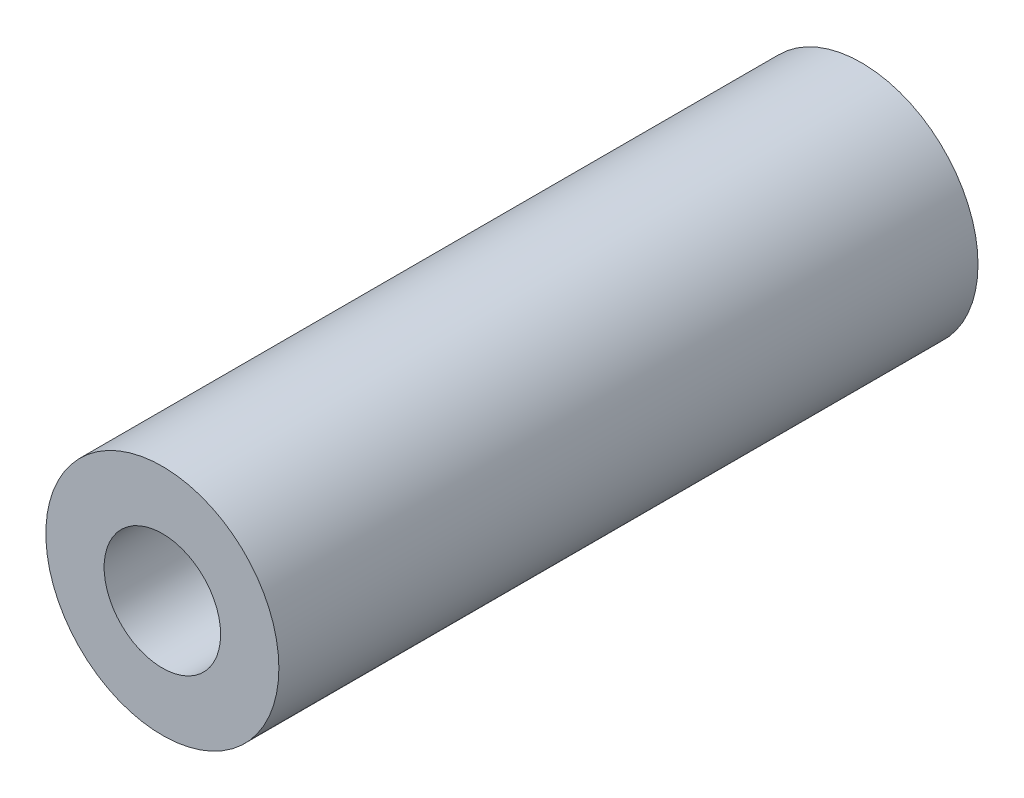
ISO-10303-21;
HEADER;
FILE_DESCRIPTION(('STEP AP214'),'2;1');
FILE_NAME('part.step','',(''),(''),'','','');
FILE_SCHEMA(('AUTOMOTIVE_DESIGN { 1 0 10303 214 1 1 1 1 }'));
ENDSEC;
DATA;
#1=APPLICATION_CONTEXT('core data for automotive mechanical design processes');
#2=APPLICATION_PROTOCOL_DEFINITION('international standard','automotive_design',2000,#1);
#3=PRODUCT_CONTEXT('',#1,'mechanical');
#4=PRODUCT('Part','Part','',(#3));
#5=PRODUCT_RELATED_PRODUCT_CATEGORY('part','',(#4));
#6=PRODUCT_DEFINITION_FORMATION('','',#4);
#7=PRODUCT_DEFINITION_CONTEXT('part definition',#1,'design');
#8=PRODUCT_DEFINITION('design','',#6,#7);
#9=PRODUCT_DEFINITION_SHAPE('','',#8);
#10=(LENGTH_UNIT() NAMED_UNIT(*) SI_UNIT(.MILLI.,.METRE.));
#11=(NAMED_UNIT(*) PLANE_ANGLE_UNIT() SI_UNIT($,.RADIAN.));
#12=(NAMED_UNIT(*) SI_UNIT($,.STERADIAN.) SOLID_ANGLE_UNIT());
#13=UNCERTAINTY_MEASURE_WITH_UNIT(LENGTH_MEASURE(1.E-05),#10,'distance_accuracy_value','');
#14=(GEOMETRIC_REPRESENTATION_CONTEXT(3) GLOBAL_UNCERTAINTY_ASSIGNED_CONTEXT((#13)) GLOBAL_UNIT_ASSIGNED_CONTEXT((#10,
#11,#12)) REPRESENTATION_CONTEXT('',''));
#15=CARTESIAN_POINT('',(0.,0.,0.));
#16=DIRECTION('',(0.,0.,1.));
#17=DIRECTION('',(1.,0.,0.));
#18=AXIS2_PLACEMENT_3D('',#15,#16,#17);
#19=CARTESIAN_POINT('',(0.,0.,30.));
#20=DIRECTION('',(0.,0.,1.));
#21=DIRECTION('',(1.,0.,0.));
#22=AXIS2_PLACEMENT_3D('',#19,#20,#21);
#23=PLANE('',#22);
#24=CARTESIAN_POINT('',(0.,0.,30.));
#25=DIRECTION('',(0.,0.,1.));
#26=DIRECTION('',(1.,0.,0.));
#27=AXIS2_PLACEMENT_3D('',#24,#25,#26);
#28=CIRCLE('',#27,5.);
#29=CARTESIAN_POINT('',(5.,0.,30.));
#30=VERTEX_POINT('',#29);
#31=EDGE_CURVE('E10',#30,#30,#28,.T.);
#32=ORIENTED_EDGE('',*,*,#31,.T.);
#33=EDGE_LOOP('',(#32));
#34=FACE_BOUND('',#33,.T.);
#35=CARTESIAN_POINT('',(0.,0.,30.));
#36=DIRECTION('',(0.,0.,1.));
#37=DIRECTION('',(1.,0.,0.));
#38=AXIS2_PLACEMENT_3D('',#35,#36,#37);
#39=CIRCLE('',#38,2.5);
#40=CARTESIAN_POINT('',(2.5,0.,30.));
#41=VERTEX_POINT('',#40);
#42=EDGE_CURVE('E42',#41,#41,#39,.T.);
#43=ORIENTED_EDGE('',*,*,#42,.F.);
#44=EDGE_LOOP('',(#43));
#45=FACE_BOUND('',#44,.T.);
#46=ADVANCED_FACE('F31',(#34,#45),#23,.T.);
#47=CARTESIAN_POINT('',(0.,0.,0.));
#48=DIRECTION('',(0.,0.,1.));
#49=DIRECTION('',(1.,0.,0.));
#50=AXIS2_PLACEMENT_3D('',#47,#48,#49);
#51=PLANE('',#50);
#52=CARTESIAN_POINT('',(0.,0.,0.));
#53=DIRECTION('',(0.,0.,1.));
#54=DIRECTION('',(1.,0.,0.));
#55=AXIS2_PLACEMENT_3D('',#52,#53,#54);
#56=CIRCLE('',#55,5.);
#57=CARTESIAN_POINT('',(5.,0.,0.));
#58=VERTEX_POINT('',#57);
#59=EDGE_CURVE('E35',#58,#58,#56,.T.);
#60=ORIENTED_EDGE('',*,*,#59,.F.);
#61=EDGE_LOOP('',(#60));
#62=FACE_BOUND('',#61,.T.);
#63=CARTESIAN_POINT('',(0.,0.,0.));
#64=DIRECTION('',(0.,0.,1.));
#65=DIRECTION('',(1.,0.,0.));
#66=AXIS2_PLACEMENT_3D('',#63,#64,#65);
#67=CIRCLE('',#66,2.5);
#68=CARTESIAN_POINT('',(2.5,0.,0.));
#69=VERTEX_POINT('',#68);
#70=EDGE_CURVE('E44',#69,#69,#67,.T.);
#71=ORIENTED_EDGE('',*,*,#70,.T.);
#72=EDGE_LOOP('',(#71));
#73=FACE_BOUND('',#72,.T.);
#74=ADVANCED_FACE('F54',(#62,#73),#51,.F.);
#75=CARTESIAN_POINT('',(0.,0.,30.));
#76=DIRECTION('',(0.,0.,-1.));
#77=DIRECTION('',(-1.,0.,0.));
#78=AXIS2_PLACEMENT_3D('',#75,#76,#77);
#79=CYLINDRICAL_SURFACE('',#78,5.);
#80=ORIENTED_EDGE('',*,*,#31,.F.);
#81=EDGE_LOOP('',(#80));
#82=FACE_BOUND('',#81,.T.);
#83=ORIENTED_EDGE('',*,*,#59,.T.);
#84=EDGE_LOOP('',(#83));
#85=FACE_BOUND('',#84,.T.);
#86=ADVANCED_FACE('F33',(#82,#85),#79,.T.);
#87=CARTESIAN_POINT('',(0.,0.,30.));
#88=DIRECTION('',(0.,0.,-1.));
#89=DIRECTION('',(-1.,0.,0.));
#90=AXIS2_PLACEMENT_3D('',#87,#88,#89);
#91=CYLINDRICAL_SURFACE('',#90,2.5);
#92=ORIENTED_EDGE('',*,*,#42,.T.);
#93=EDGE_LOOP('',(#92));
#94=FACE_BOUND('',#93,.T.);
#95=ORIENTED_EDGE('',*,*,#70,.F.);
#96=EDGE_LOOP('',(#95));
#97=FACE_BOUND('',#96,.T.);
#98=ADVANCED_FACE('F50',(#94,#97),#91,.F.);
#99=CLOSED_SHELL('',(#46,#74,#86,#98));
#100=MANIFOLD_SOLID_BREP('B2',#99);
#101=ADVANCED_BREP_SHAPE_REPRESENTATION('',(#18,#100),#14);
#102=SHAPE_DEFINITION_REPRESENTATION(#9,#101);
ENDSEC;
END-ISO-10303-21;
